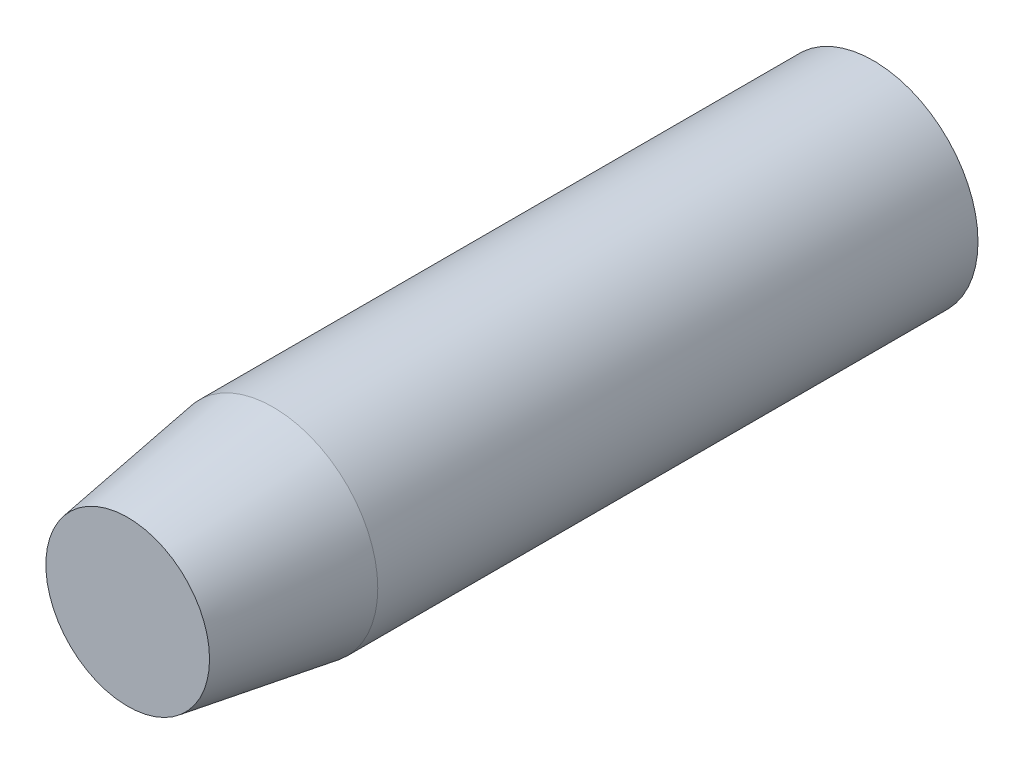
ISO-10303-21;
HEADER;
FILE_DESCRIPTION(('STEP AP214'),'2;1');
FILE_NAME('part.step','',(''),(''),'','','');
FILE_SCHEMA(('AUTOMOTIVE_DESIGN { 1 0 10303 214 1 1 1 1 }'));
ENDSEC;
DATA;
#1=APPLICATION_CONTEXT('core data for automotive mechanical design processes');
#2=APPLICATION_PROTOCOL_DEFINITION('international standard','automotive_design',2000,#1);
#3=PRODUCT_CONTEXT('',#1,'mechanical');
#4=PRODUCT('Part','Part','',(#3));
#5=PRODUCT_RELATED_PRODUCT_CATEGORY('part','',(#4));
#6=PRODUCT_DEFINITION_FORMATION('','',#4);
#7=PRODUCT_DEFINITION_CONTEXT('part definition',#1,'design');
#8=PRODUCT_DEFINITION('design','',#6,#7);
#9=PRODUCT_DEFINITION_SHAPE('','',#8);
#10=(LENGTH_UNIT() NAMED_UNIT(*) SI_UNIT(.MILLI.,.METRE.));
#11=(NAMED_UNIT(*) PLANE_ANGLE_UNIT() SI_UNIT($,.RADIAN.));
#12=(NAMED_UNIT(*) SI_UNIT($,.STERADIAN.) SOLID_ANGLE_UNIT());
#13=UNCERTAINTY_MEASURE_WITH_UNIT(LENGTH_MEASURE(1.E-05),#10,'distance_accuracy_value','');
#14=(GEOMETRIC_REPRESENTATION_CONTEXT(3) GLOBAL_UNCERTAINTY_ASSIGNED_CONTEXT((#13)) GLOBAL_UNIT_ASSIGNED_CONTEXT((#10,
#11,#12)) REPRESENTATION_CONTEXT('',''));
#15=CARTESIAN_POINT('',(0.,0.,0.));
#16=DIRECTION('',(0.,0.,1.));
#17=DIRECTION('',(1.,0.,0.));
#18=AXIS2_PLACEMENT_3D('',#15,#16,#17);
#19=CARTESIAN_POINT('',(0.,0.,65.0875));
#20=DIRECTION('',(0.,0.,-1.));
#21=DIRECTION('',(-1.,0.,0.));
#22=AXIS2_PLACEMENT_3D('',#19,#20,#21);
#23=CYLINDRICAL_SURFACE('',#22,18.25625);
#24=CARTESIAN_POINT('',(0.,0.,39.6874999999998));
#25=DIRECTION('',(0.,0.,1.));
#26=DIRECTION('',(1.,0.,0.));
#27=AXIS2_PLACEMENT_3D('',#24,#25,#26);
#28=CIRCLE('',#27,18.25625);
#29=CARTESIAN_POINT('',(18.25625,0.,39.6874999999998));
#30=VERTEX_POINT('',#29);
#31=EDGE_CURVE('E10',#30,#30,#28,.F.);
#32=ORIENTED_EDGE('',*,*,#31,.T.);
#33=EDGE_LOOP('',(#32));
#34=FACE_BOUND('',#33,.T.);
#35=CARTESIAN_POINT('',(0.,0.,-65.0875));
#36=DIRECTION('',(0.,0.,1.));
#37=DIRECTION('',(1.,0.,0.));
#38=AXIS2_PLACEMENT_3D('',#35,#36,#37);
#39=CIRCLE('',#38,18.25625);
#40=CARTESIAN_POINT('',(18.25625,0.,-65.0875));
#41=VERTEX_POINT('',#40);
#42=EDGE_CURVE('E46',#41,#41,#39,.T.);
#43=ORIENTED_EDGE('',*,*,#42,.T.);
#44=EDGE_LOOP('',(#43));
#45=FACE_BOUND('',#44,.T.);
#46=ADVANCED_FACE('F35',(#34,#45),#23,.T.);
#47=CARTESIAN_POINT('',(0.,0.,65.0875));
#48=DIRECTION('',(0.,0.,1.));
#49=DIRECTION('',(1.,0.,0.));
#50=AXIS2_PLACEMENT_3D('',#47,#48,#49);
#51=PLANE('',#50);
#52=CARTESIAN_POINT('',(0.,0.,65.0875));
#53=DIRECTION('',(0.,0.,1.));
#54=DIRECTION('',(1.,0.,0.));
#55=AXIS2_PLACEMENT_3D('',#52,#53,#54);
#56=CIRCLE('',#55,14.2875000000001);
#57=CARTESIAN_POINT('',(14.2875000000001,0.,65.0875));
#58=VERTEX_POINT('',#57);
#59=EDGE_CURVE('E42',#58,#58,#56,.T.);
#60=ORIENTED_EDGE('',*,*,#59,.T.);
#61=EDGE_LOOP('',(#60));
#62=FACE_BOUND('',#61,.T.);
#63=ADVANCED_FACE('F56',(#62),#51,.T.);
#64=CARTESIAN_POINT('',(0.,0.,-65.0875));
#65=DIRECTION('',(0.,0.,1.));
#66=DIRECTION('',(1.,0.,0.));
#67=AXIS2_PLACEMENT_3D('',#64,#65,#66);
#68=PLANE('',#67);
#69=ORIENTED_EDGE('',*,*,#42,.F.);
#70=EDGE_LOOP('',(#69));
#71=FACE_BOUND('',#70,.T.);
#72=ADVANCED_FACE('F54',(#71),#68,.F.);
#73=CARTESIAN_POINT('',(0.,0.,65.0875));
#74=DIRECTION('',(0.,0.,-1.));
#75=DIRECTION('',(-1.,0.,0.));
#76=AXIS2_PLACEMENT_3D('',#73,#74,#75);
#77=CONICAL_SURFACE('',#76,14.2875000000001,0.154996741923938);
#78=ORIENTED_EDGE('',*,*,#31,.F.);
#79=EDGE_LOOP('',(#78));
#80=FACE_BOUND('',#79,.T.);
#81=ORIENTED_EDGE('',*,*,#59,.F.);
#82=EDGE_LOOP('',(#81));
#83=FACE_BOUND('',#82,.T.);
#84=ADVANCED_FACE('F37',(#80,#83),#77,.T.);
#85=CLOSED_SHELL('',(#46,#63,#72,#84));
#86=MANIFOLD_SOLID_BREP('B2',#85);
#87=ADVANCED_BREP_SHAPE_REPRESENTATION('',(#18,#86),#14);
#88=SHAPE_DEFINITION_REPRESENTATION(#9,#87);
ENDSEC;
END-ISO-10303-21;
